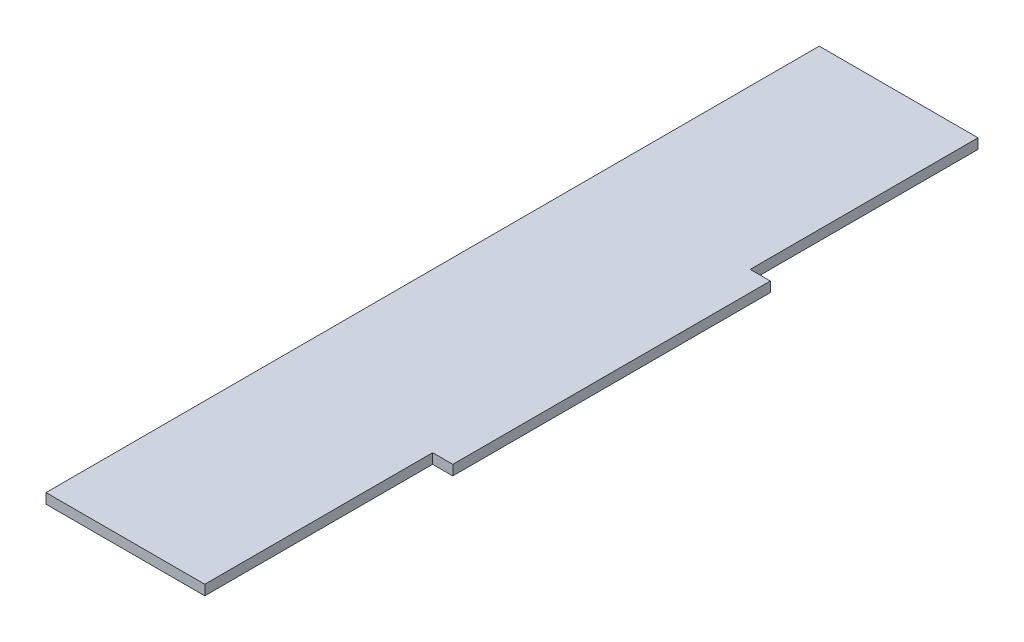
ISO-10303-21;
HEADER;
FILE_DESCRIPTION(('STEP AP214'),'2;1');
FILE_NAME('part.step','',(''),(''),'','','');
FILE_SCHEMA(('AUTOMOTIVE_DESIGN { 1 0 10303 214 1 1 1 1 }'));
ENDSEC;
DATA;
#1=APPLICATION_CONTEXT('core data for automotive mechanical design processes');
#2=APPLICATION_PROTOCOL_DEFINITION('international standard','automotive_design',2000,#1);
#3=PRODUCT_CONTEXT('',#1,'mechanical');
#4=PRODUCT('Part','Part','',(#3));
#5=PRODUCT_RELATED_PRODUCT_CATEGORY('part','',(#4));
#6=PRODUCT_DEFINITION_FORMATION('','',#4);
#7=PRODUCT_DEFINITION_CONTEXT('part definition',#1,'design');
#8=PRODUCT_DEFINITION('design','',#6,#7);
#9=PRODUCT_DEFINITION_SHAPE('','',#8);
#10=(LENGTH_UNIT() NAMED_UNIT(*) SI_UNIT(.MILLI.,.METRE.));
#11=(NAMED_UNIT(*) PLANE_ANGLE_UNIT() SI_UNIT($,.RADIAN.));
#12=(NAMED_UNIT(*) SI_UNIT($,.STERADIAN.) SOLID_ANGLE_UNIT());
#13=UNCERTAINTY_MEASURE_WITH_UNIT(LENGTH_MEASURE(1.E-05),#10,'distance_accuracy_value','');
#14=(GEOMETRIC_REPRESENTATION_CONTEXT(3) GLOBAL_UNCERTAINTY_ASSIGNED_CONTEXT((#13)) GLOBAL_UNIT_ASSIGNED_CONTEXT((#10,
#11,#12)) REPRESENTATION_CONTEXT('',''));
#15=CARTESIAN_POINT('',(0.,0.,0.));
#16=DIRECTION('',(0.,0.,1.));
#17=DIRECTION('',(1.,0.,0.));
#18=AXIS2_PLACEMENT_3D('',#15,#16,#17);
#19=CARTESIAN_POINT('',(-25.,3.175,0.));
#20=DIRECTION('',(-1.,0.,0.));
#21=DIRECTION('',(0.,0.,1.));
#22=AXIS2_PLACEMENT_3D('',#19,#20,#21);
#23=PLANE('',#22);
#24=DIRECTION('',(0.,0.,-1.));
#25=VECTOR('',#24,1.);
#26=CARTESIAN_POINT('',(-25.,0.,0.));
#27=LINE('',#26,#25);
#28=CARTESIAN_POINT('',(-25.,0.,171.75));
#29=VERTEX_POINT('',#28);
#30=CARTESIAN_POINT('',(-25.,0.,-71.75));
#31=VERTEX_POINT('',#30);
#32=EDGE_CURVE('E127',#29,#31,#27,.T.);
#33=ORIENTED_EDGE('',*,*,#32,.F.);
#34=DIRECTION('',(0.,-1.,0.));
#35=VECTOR('',#34,1.);
#36=CARTESIAN_POINT('',(-25.,3.175,171.75));
#37=LINE('',#36,#35);
#38=CARTESIAN_POINT('',(-25.,3.175,171.75));
#39=VERTEX_POINT('',#38);
#40=EDGE_CURVE('E11',#39,#29,#37,.T.);
#41=ORIENTED_EDGE('',*,*,#40,.F.);
#42=DIRECTION('',(0.,0.,-1.));
#43=VECTOR('',#42,1.);
#44=CARTESIAN_POINT('',(-25.,3.175,0.));
#45=LINE('',#44,#43);
#46=CARTESIAN_POINT('',(-25.,3.175,-71.75));
#47=VERTEX_POINT('',#46);
#48=EDGE_CURVE('E147',#39,#47,#45,.T.);
#49=ORIENTED_EDGE('',*,*,#48,.T.);
#50=DIRECTION('',(0.,-1.,0.));
#51=VECTOR('',#50,1.);
#52=CARTESIAN_POINT('',(-25.,3.175,-71.75));
#53=LINE('',#52,#51);
#54=EDGE_CURVE('E50',#47,#31,#53,.T.);
#55=ORIENTED_EDGE('',*,*,#54,.T.);
#56=EDGE_LOOP('',(#33,#41,#49,#55));
#57=FACE_BOUND('',#56,.T.);
#58=ADVANCED_FACE('F34',(#57),#23,.T.);
#59=CARTESIAN_POINT('',(0.,3.175,171.75));
#60=DIRECTION('',(0.,0.,1.));
#61=DIRECTION('',(1.,0.,0.));
#62=AXIS2_PLACEMENT_3D('',#59,#60,#61);
#63=PLANE('',#62);
#64=DIRECTION('',(-1.,0.,0.));
#65=VECTOR('',#64,1.);
#66=CARTESIAN_POINT('',(0.,0.,171.75));
#67=LINE('',#66,#65);
#68=CARTESIAN_POINT('',(25.,0.,171.75));
#69=VERTEX_POINT('',#68);
#70=EDGE_CURVE('E129',#69,#29,#67,.T.);
#71=ORIENTED_EDGE('',*,*,#70,.F.);
#72=DIRECTION('',(0.,-1.,0.));
#73=VECTOR('',#72,1.);
#74=CARTESIAN_POINT('',(25.,3.175,171.75));
#75=LINE('',#74,#73);
#76=CARTESIAN_POINT('',(25.,3.175,171.75));
#77=VERTEX_POINT('',#76);
#78=EDGE_CURVE('E42',#77,#69,#75,.T.);
#79=ORIENTED_EDGE('',*,*,#78,.F.);
#80=DIRECTION('',(-1.,0.,0.));
#81=VECTOR('',#80,1.);
#82=CARTESIAN_POINT('',(0.,3.175,171.75));
#83=LINE('',#82,#81);
#84=EDGE_CURVE('E173',#77,#39,#83,.T.);
#85=ORIENTED_EDGE('',*,*,#84,.T.);
#86=ORIENTED_EDGE('',*,*,#40,.T.);
#87=EDGE_LOOP('',(#71,#79,#85,#86));
#88=FACE_BOUND('',#87,.T.);
#89=ADVANCED_FACE('F164',(#88),#63,.T.);
#90=CARTESIAN_POINT('',(25.,3.175,0.));
#91=DIRECTION('',(1.,0.,0.));
#92=DIRECTION('',(0.,0.,-1.));
#93=AXIS2_PLACEMENT_3D('',#90,#91,#92);
#94=PLANE('',#93);
#95=DIRECTION('',(0.,0.,1.));
#96=VECTOR('',#95,1.);
#97=CARTESIAN_POINT('',(25.,0.,0.));
#98=LINE('',#97,#96);
#99=CARTESIAN_POINT('',(25.,0.,100.));
#100=VERTEX_POINT('',#99);
#101=EDGE_CURVE('E132',#100,#69,#98,.T.);
#102=ORIENTED_EDGE('',*,*,#101,.F.);
#103=DIRECTION('',(0.,-1.,0.));
#104=VECTOR('',#103,1.);
#105=CARTESIAN_POINT('',(25.,3.175,100.));
#106=LINE('',#105,#104);
#107=CARTESIAN_POINT('',(25.,3.175,100.));
#108=VERTEX_POINT('',#107);
#109=EDGE_CURVE('E153',#108,#100,#106,.T.);
#110=ORIENTED_EDGE('',*,*,#109,.F.);
#111=DIRECTION('',(0.,0.,1.));
#112=VECTOR('',#111,1.);
#113=CARTESIAN_POINT('',(25.,3.175,0.));
#114=LINE('',#113,#112);
#115=EDGE_CURVE('E160',#108,#77,#114,.T.);
#116=ORIENTED_EDGE('',*,*,#115,.T.);
#117=ORIENTED_EDGE('',*,*,#78,.T.);
#118=EDGE_LOOP('',(#102,#110,#116,#117));
#119=FACE_BOUND('',#118,.T.);
#120=ADVANCED_FACE('F158',(#119),#94,.T.);
#121=CARTESIAN_POINT('',(0.,3.175,100.));
#122=DIRECTION('',(0.,0.,1.));
#123=DIRECTION('',(1.,0.,0.));
#124=AXIS2_PLACEMENT_3D('',#121,#122,#123);
#125=PLANE('',#124);
#126=DIRECTION('',(-1.,0.,0.));
#127=VECTOR('',#126,1.);
#128=CARTESIAN_POINT('',(0.,0.,100.));
#129=LINE('',#128,#127);
#130=CARTESIAN_POINT('',(31.35,0.,100.));
#131=VERTEX_POINT('',#130);
#132=EDGE_CURVE('E135',#131,#100,#129,.T.);
#133=ORIENTED_EDGE('',*,*,#132,.F.);
#134=DIRECTION('',(0.,-1.,0.));
#135=VECTOR('',#134,1.);
#136=CARTESIAN_POINT('',(31.35,3.175,100.));
#137=LINE('',#136,#135);
#138=CARTESIAN_POINT('',(31.35,3.175,100.));
#139=VERTEX_POINT('',#138);
#140=EDGE_CURVE('E151',#139,#131,#137,.T.);
#141=ORIENTED_EDGE('',*,*,#140,.F.);
#142=DIRECTION('',(-1.,0.,0.));
#143=VECTOR('',#142,1.);
#144=CARTESIAN_POINT('',(0.,3.175,100.));
#145=LINE('',#144,#143);
#146=EDGE_CURVE('E172',#139,#108,#145,.T.);
#147=ORIENTED_EDGE('',*,*,#146,.T.);
#148=ORIENTED_EDGE('',*,*,#109,.T.);
#149=EDGE_LOOP('',(#133,#141,#147,#148));
#150=FACE_BOUND('',#149,.T.);
#151=ADVANCED_FACE('F170',(#150),#125,.T.);
#152=CARTESIAN_POINT('',(31.35,3.175,0.));
#153=DIRECTION('',(1.,0.,0.));
#154=DIRECTION('',(0.,0.,-1.));
#155=AXIS2_PLACEMENT_3D('',#152,#153,#154);
#156=PLANE('',#155);
#157=DIRECTION('',(0.,0.,1.));
#158=VECTOR('',#157,1.);
#159=CARTESIAN_POINT('',(31.35,0.,0.));
#160=LINE('',#159,#158);
#161=CARTESIAN_POINT('',(31.35,0.,0.));
#162=VERTEX_POINT('',#161);
#163=EDGE_CURVE('E138',#162,#131,#160,.T.);
#164=ORIENTED_EDGE('',*,*,#163,.F.);
#165=DIRECTION('',(0.,-1.,0.));
#166=VECTOR('',#165,1.);
#167=CARTESIAN_POINT('',(31.35,3.175,0.));
#168=LINE('',#167,#166);
#169=CARTESIAN_POINT('',(31.35,3.175,0.));
#170=VERTEX_POINT('',#169);
#171=EDGE_CURVE('E109',#170,#162,#168,.T.);
#172=ORIENTED_EDGE('',*,*,#171,.F.);
#173=DIRECTION('',(0.,0.,1.));
#174=VECTOR('',#173,1.);
#175=CARTESIAN_POINT('',(31.35,3.175,0.));
#176=LINE('',#175,#174);
#177=EDGE_CURVE('E119',#170,#139,#176,.T.);
#178=ORIENTED_EDGE('',*,*,#177,.T.);
#179=ORIENTED_EDGE('',*,*,#140,.T.);
#180=EDGE_LOOP('',(#164,#172,#178,#179));
#181=FACE_BOUND('',#180,.T.);
#182=ADVANCED_FACE('F179',(#181),#156,.T.);
#183=CARTESIAN_POINT('',(0.,3.175,0.));
#184=DIRECTION('',(0.,0.,-1.));
#185=DIRECTION('',(-1.,0.,0.));
#186=AXIS2_PLACEMENT_3D('',#183,#184,#185);
#187=PLANE('',#186);
#188=DIRECTION('',(1.,0.,0.));
#189=VECTOR('',#188,1.);
#190=CARTESIAN_POINT('',(0.,0.,0.));
#191=LINE('',#190,#189);
#192=CARTESIAN_POINT('',(25.,0.,0.));
#193=VERTEX_POINT('',#192);
#194=EDGE_CURVE('E105',#193,#162,#191,.T.);
#195=ORIENTED_EDGE('',*,*,#194,.F.);
#196=DIRECTION('',(0.,-1.,0.));
#197=VECTOR('',#196,1.);
#198=CARTESIAN_POINT('',(25.,3.175,0.));
#199=LINE('',#198,#197);
#200=CARTESIAN_POINT('',(25.,3.175,0.));
#201=VERTEX_POINT('',#200);
#202=EDGE_CURVE('E100',#201,#193,#199,.T.);
#203=ORIENTED_EDGE('',*,*,#202,.F.);
#204=DIRECTION('',(1.,0.,0.));
#205=VECTOR('',#204,1.);
#206=CARTESIAN_POINT('',(0.,3.175,0.));
#207=LINE('',#206,#205);
#208=EDGE_CURVE('E103',#201,#170,#207,.T.);
#209=ORIENTED_EDGE('',*,*,#208,.T.);
#210=ORIENTED_EDGE('',*,*,#171,.T.);
#211=EDGE_LOOP('',(#195,#203,#209,#210));
#212=FACE_BOUND('',#211,.T.);
#213=ADVANCED_FACE('F102',(#212),#187,.T.);
#214=CARTESIAN_POINT('',(25.,3.175,0.));
#215=DIRECTION('',(1.,0.,0.));
#216=DIRECTION('',(0.,0.,-1.));
#217=AXIS2_PLACEMENT_3D('',#214,#215,#216);
#218=PLANE('',#217);
#219=DIRECTION('',(0.,0.,1.));
#220=VECTOR('',#219,1.);
#221=CARTESIAN_POINT('',(25.,0.,0.));
#222=LINE('',#221,#220);
#223=CARTESIAN_POINT('',(25.,0.,-71.75));
#224=VERTEX_POINT('',#223);
#225=EDGE_CURVE('E142',#224,#193,#222,.T.);
#226=ORIENTED_EDGE('',*,*,#225,.F.);
#227=DIRECTION('',(0.,-1.,0.));
#228=VECTOR('',#227,1.);
#229=CARTESIAN_POINT('',(25.,3.175,-71.75));
#230=LINE('',#229,#228);
#231=CARTESIAN_POINT('',(25.,3.175,-71.75));
#232=VERTEX_POINT('',#231);
#233=EDGE_CURVE('E75',#232,#224,#230,.T.);
#234=ORIENTED_EDGE('',*,*,#233,.F.);
#235=DIRECTION('',(0.,0.,1.));
#236=VECTOR('',#235,1.);
#237=CARTESIAN_POINT('',(25.,3.175,0.));
#238=LINE('',#237,#236);
#239=EDGE_CURVE('E116',#232,#201,#238,.T.);
#240=ORIENTED_EDGE('',*,*,#239,.T.);
#241=ORIENTED_EDGE('',*,*,#202,.T.);
#242=EDGE_LOOP('',(#226,#234,#240,#241));
#243=FACE_BOUND('',#242,.T.);
#244=ADVANCED_FACE('F121',(#243),#218,.T.);
#245=CARTESIAN_POINT('',(0.,3.175,-71.75));
#246=DIRECTION('',(0.,0.,-1.));
#247=DIRECTION('',(-1.,0.,0.));
#248=AXIS2_PLACEMENT_3D('',#245,#246,#247);
#249=PLANE('',#248);
#250=DIRECTION('',(1.,0.,0.));
#251=VECTOR('',#250,1.);
#252=CARTESIAN_POINT('',(0.,0.,-71.75));
#253=LINE('',#252,#251);
#254=EDGE_CURVE('E144',#31,#224,#253,.T.);
#255=ORIENTED_EDGE('',*,*,#254,.F.);
#256=ORIENTED_EDGE('',*,*,#54,.F.);
#257=DIRECTION('',(1.,0.,0.));
#258=VECTOR('',#257,1.);
#259=CARTESIAN_POINT('',(0.,3.175,-71.75));
#260=LINE('',#259,#258);
#261=EDGE_CURVE('E122',#47,#232,#260,.T.);
#262=ORIENTED_EDGE('',*,*,#261,.T.);
#263=ORIENTED_EDGE('',*,*,#233,.T.);
#264=EDGE_LOOP('',(#255,#256,#262,#263));
#265=FACE_BOUND('',#264,.T.);
#266=ADVANCED_FACE('F180',(#265),#249,.T.);
#267=CARTESIAN_POINT('',(0.,3.175,0.));
#268=DIRECTION('',(0.,1.,0.));
#269=DIRECTION('',(0.,0.,1.));
#270=AXIS2_PLACEMENT_3D('',#267,#268,#269);
#271=PLANE('',#270);
#272=ORIENTED_EDGE('',*,*,#48,.F.);
#273=ORIENTED_EDGE('',*,*,#84,.F.);
#274=ORIENTED_EDGE('',*,*,#115,.F.);
#275=ORIENTED_EDGE('',*,*,#146,.F.);
#276=ORIENTED_EDGE('',*,*,#177,.F.);
#277=ORIENTED_EDGE('',*,*,#208,.F.);
#278=ORIENTED_EDGE('',*,*,#239,.F.);
#279=ORIENTED_EDGE('',*,*,#261,.F.);
#280=EDGE_LOOP('',(#272,#273,#274,#275,#276,#277,#278,#279));
#281=FACE_BOUND('',#280,.T.);
#282=ADVANCED_FACE('F114',(#281),#271,.T.);
#283=CARTESIAN_POINT('',(0.,0.,0.));
#284=DIRECTION('',(0.,1.,0.));
#285=DIRECTION('',(0.,0.,1.));
#286=AXIS2_PLACEMENT_3D('',#283,#284,#285);
#287=PLANE('',#286);
#288=ORIENTED_EDGE('',*,*,#32,.T.);
#289=ORIENTED_EDGE('',*,*,#254,.T.);
#290=ORIENTED_EDGE('',*,*,#225,.T.);
#291=ORIENTED_EDGE('',*,*,#194,.T.);
#292=ORIENTED_EDGE('',*,*,#163,.T.);
#293=ORIENTED_EDGE('',*,*,#132,.T.);
#294=ORIENTED_EDGE('',*,*,#101,.T.);
#295=ORIENTED_EDGE('',*,*,#70,.T.);
#296=EDGE_LOOP('',(#288,#289,#290,#291,#292,#293,#294,#295));
#297=FACE_BOUND('',#296,.T.);
#298=ADVANCED_FACE('F166',(#297),#287,.F.);
#299=CLOSED_SHELL('',(#58,#89,#120,#151,#182,#213,#244,#266,#282,#298));
#300=MANIFOLD_SOLID_BREP('B2',#299);
#301=ADVANCED_BREP_SHAPE_REPRESENTATION('',(#18,#300),#14);
#302=SHAPE_DEFINITION_REPRESENTATION(#9,#301);
ENDSEC;
END-ISO-10303-21;
